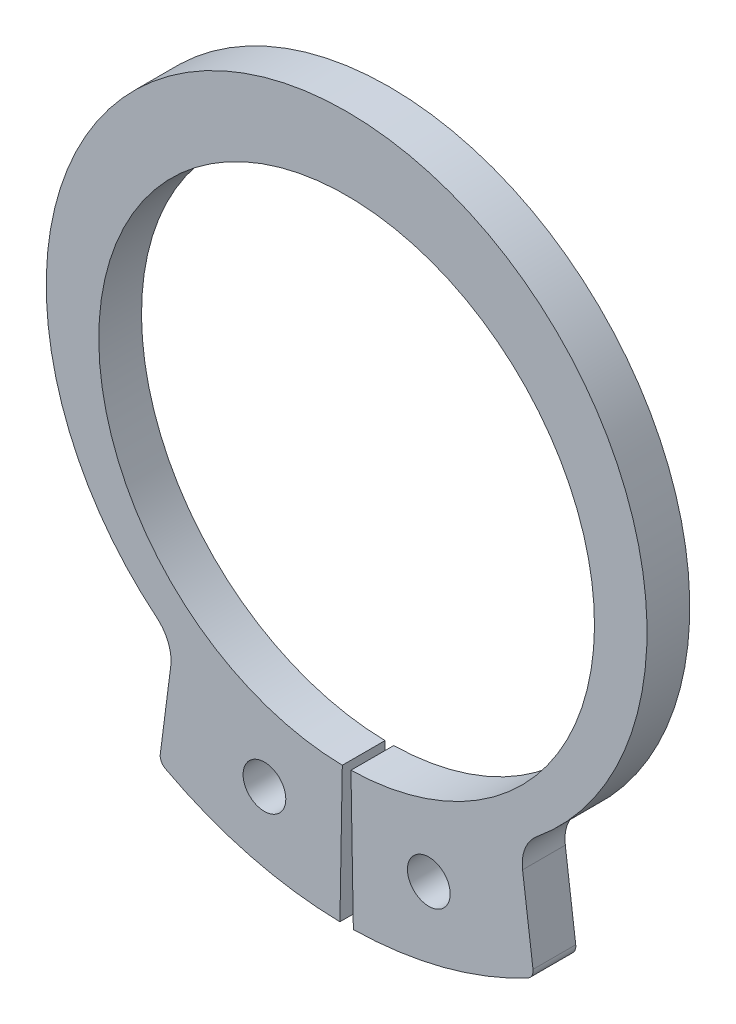
ISO-10303-21;
HEADER;
FILE_DESCRIPTION(('STEP AP214'),'2;1');
FILE_NAME('part.step','',(''),(''),'','','');
FILE_SCHEMA(('AUTOMOTIVE_DESIGN { 1 0 10303 214 1 1 1 1 }'));
ENDSEC;
DATA;
#1=APPLICATION_CONTEXT('core data for automotive mechanical design processes');
#2=APPLICATION_PROTOCOL_DEFINITION('international standard','automotive_design',2000,#1);
#3=PRODUCT_CONTEXT('',#1,'mechanical');
#4=PRODUCT('Part','Part','',(#3));
#5=PRODUCT_RELATED_PRODUCT_CATEGORY('part','',(#4));
#6=PRODUCT_DEFINITION_FORMATION('','',#4);
#7=PRODUCT_DEFINITION_CONTEXT('part definition',#1,'design');
#8=PRODUCT_DEFINITION('design','',#6,#7);
#9=PRODUCT_DEFINITION_SHAPE('','',#8);
#10=(LENGTH_UNIT() NAMED_UNIT(*) SI_UNIT(.MILLI.,.METRE.));
#11=(NAMED_UNIT(*) PLANE_ANGLE_UNIT() SI_UNIT($,.RADIAN.));
#12=(NAMED_UNIT(*) SI_UNIT($,.STERADIAN.) SOLID_ANGLE_UNIT());
#13=UNCERTAINTY_MEASURE_WITH_UNIT(LENGTH_MEASURE(1.E-05),#10,'distance_accuracy_value','');
#14=(GEOMETRIC_REPRESENTATION_CONTEXT(3) GLOBAL_UNCERTAINTY_ASSIGNED_CONTEXT((#13)) GLOBAL_UNIT_ASSIGNED_CONTEXT((#10,
#11,#12)) REPRESENTATION_CONTEXT('',''));
#15=CARTESIAN_POINT('',(0.,0.,0.));
#16=DIRECTION('',(0.,0.,1.));
#17=DIRECTION('',(1.,0.,0.));
#18=AXIS2_PLACEMENT_3D('',#15,#16,#17);
#19=CARTESIAN_POINT('',(0.,0.941428346580996,1.));
#20=DIRECTION('',(0.,0.,1.));
#21=DIRECTION('',(1.,0.,0.));
#22=AXIS2_PLACEMENT_3D('',#19,#20,#21);
#23=PLANE('',#22);
#24=DIRECTION('',(-0.127590580964938,-0.991826922224351,0.));
#25=VECTOR('',#24,1.);
#26=CARTESIAN_POINT('',(-8.76223313562183,-15.726474066602,1.));
#27=LINE('',#26,#25);
#28=CARTESIAN_POINT('',(-8.2337790965981,-11.6185302113579,1.));
#29=VERTEX_POINT('',#28);
#30=CARTESIAN_POINT('',(-8.72163862360933,-15.410912137155,1.));
#31=VERTEX_POINT('',#30);
#32=EDGE_CURVE('E193',#29,#31,#27,.T.);
#33=ORIENTED_EDGE('',*,*,#32,.T.);
#34=CARTESIAN_POINT('',(-8.26003790730853,-15.4702933681409,1.));
#35=DIRECTION('',(0.,0.,1.));
#36=DIRECTION('',(1.,0.,0.));
#37=AXIS2_PLACEMENT_3D('',#34,#35,#36);
#38=CIRCLE('',#37,0.46540450350509);
#39=CARTESIAN_POINT('',(-8.47924215440834,-15.8808428169729,1.));
#40=VERTEX_POINT('',#39);
#41=EDGE_CURVE('E12',#31,#40,#38,.T.);
#42=ORIENTED_EDGE('',*,*,#41,.T.);
#43=CARTESIAN_POINT('',(0.,0.,1.));
#44=DIRECTION('',(0.,0.,1.));
#45=DIRECTION('',(1.,0.,0.));
#46=AXIS2_PLACEMENT_3D('',#43,#44,#45);
#47=CIRCLE('',#46,18.0027419047903);
#48=CARTESIAN_POINT('',(-0.314191168707932,-18.,1.));
#49=VERTEX_POINT('',#48);
#50=EDGE_CURVE('E196',#40,#49,#47,.T.);
#51=ORIENTED_EDGE('',*,*,#50,.T.);
#52=DIRECTION('',(0.0174524064372855,0.999847695156391,0.));
#53=VECTOR('',#52,1.);
#54=CARTESIAN_POINT('',(-0.314191168707932,-18.,1.));
#55=LINE('',#54,#53);
#56=CARTESIAN_POINT('',(-0.202447914672499,-11.5982332638141,1.));
#57=VERTEX_POINT('',#56);
#58=EDGE_CURVE('E198',#49,#57,#55,.T.);
#59=ORIENTED_EDGE('',*,*,#58,.T.);
#60=CARTESIAN_POINT('',(0.,0.,1.));
#61=DIRECTION('',(0.,0.,-1.));
#62=DIRECTION('',(1.,0.,0.));
#63=AXIS2_PLACEMENT_3D('',#60,#61,#62);
#64=CIRCLE('',#63,11.6);
#65=CARTESIAN_POINT('',(0.202447914672493,-11.5982332638141,1.));
#66=VERTEX_POINT('',#65);
#67=EDGE_CURVE('E152',#57,#66,#64,.T.);
#68=ORIENTED_EDGE('',*,*,#67,.T.);
#69=DIRECTION('',(-0.017452406437285,0.999847695156391,0.));
#70=VECTOR('',#69,1.);
#71=CARTESIAN_POINT('',(0.314191168707923,-18.,1.));
#72=LINE('',#71,#70);
#73=CARTESIAN_POINT('',(0.314191168707923,-18.,1.));
#74=VERTEX_POINT('',#73);
#75=EDGE_CURVE('E132',#74,#66,#72,.T.);
#76=ORIENTED_EDGE('',*,*,#75,.F.);
#77=CARTESIAN_POINT('',(0.,0.,1.));
#78=DIRECTION('',(0.,0.,-1.));
#79=DIRECTION('',(-1.,0.,0.));
#80=AXIS2_PLACEMENT_3D('',#77,#78,#79);
#81=CIRCLE('',#80,18.0027419047903);
#82=CARTESIAN_POINT('',(8.47924215440833,-15.8808428169729,1.));
#83=VERTEX_POINT('',#82);
#84=EDGE_CURVE('E142',#83,#74,#81,.T.);
#85=ORIENTED_EDGE('',*,*,#84,.F.);
#86=CARTESIAN_POINT('',(8.26003790730852,-15.4702933681409,1.));
#87=DIRECTION('',(0.,0.,-1.));
#88=DIRECTION('',(-1.,0.,0.));
#89=AXIS2_PLACEMENT_3D('',#86,#87,#88);
#90=CIRCLE('',#89,0.46540450350509);
#91=CARTESIAN_POINT('',(8.72163862360932,-15.410912137155,1.));
#92=VERTEX_POINT('',#91);
#93=EDGE_CURVE('E181',#92,#83,#90,.T.);
#94=ORIENTED_EDGE('',*,*,#93,.F.);
#95=DIRECTION('',(0.127590580964938,-0.991826922224351,0.));
#96=VECTOR('',#95,1.);
#97=CARTESIAN_POINT('',(8.76223313562182,-15.726474066602,1.));
#98=LINE('',#97,#96);
#99=CARTESIAN_POINT('',(8.2337790965981,-11.618530211358,1.));
#100=VERTEX_POINT('',#99);
#101=EDGE_CURVE('E148',#100,#92,#98,.T.);
#102=ORIENTED_EDGE('',*,*,#101,.F.);
#103=CARTESIAN_POINT('',(10.0801819618013,-11.3810052874143,1.));
#104=DIRECTION('',(0.,0.,-1.));
#105=DIRECTION('',(-1.,0.,0.));
#106=AXIS2_PLACEMENT_3D('',#103,#104,#105);
#107=CIRCLE('',#106,1.86161801402036);
#108=CARTESIAN_POINT('',(8.90146181356889,-9.94008875885477,1.));
#109=VERTEX_POINT('',#108);
#110=EDGE_CURVE('E172',#109,#100,#107,.F.);
#111=ORIENTED_EDGE('',*,*,#110,.F.);
#112=CARTESIAN_POINT('',(0.,0.941428346580996,1.));
#113=DIRECTION('',(0.,0.,1.));
#114=DIRECTION('',(1.,0.,0.));
#115=AXIS2_PLACEMENT_3D('',#112,#113,#114);
#116=CIRCLE('',#115,14.058571653419);
#117=CARTESIAN_POINT('',(-8.9014618135689,-9.94008875885477,1.));
#118=VERTEX_POINT('',#117);
#119=EDGE_CURVE('E190',#109,#118,#116,.T.);
#120=ORIENTED_EDGE('',*,*,#119,.T.);
#121=CARTESIAN_POINT('',(-10.0801819618013,-11.3810052874143,1.));
#122=DIRECTION('',(0.,0.,1.));
#123=DIRECTION('',(1.,0.,0.));
#124=AXIS2_PLACEMENT_3D('',#121,#122,#123);
#125=CIRCLE('',#124,1.86161801402036);
#126=EDGE_CURVE('E223',#118,#29,#125,.F.);
#127=ORIENTED_EDGE('',*,*,#126,.T.);
#128=EDGE_LOOP('',(#33,#42,#51,#59,#68,#76,#85,#94,#102,#111,#120,#127));
#129=FACE_BOUND('',#128,.T.);
#130=CARTESIAN_POINT('',(-3.84647005038051,-14.2928391239086,1.));
#131=DIRECTION('',(0.,0.,1.));
#132=DIRECTION('',(1.,0.,0.));
#133=AXIS2_PLACEMENT_3D('',#130,#131,#132);
#134=CIRCLE('',#133,1.);
#135=CARTESIAN_POINT('',(-2.84647005038051,-14.2928391239086,1.));
#136=VERTEX_POINT('',#135);
#137=EDGE_CURVE('E184',#136,#136,#134,.T.);
#138=ORIENTED_EDGE('',*,*,#137,.F.);
#139=EDGE_LOOP('',(#138));
#140=FACE_BOUND('',#139,.T.);
#141=CARTESIAN_POINT('',(3.8464700503805,-14.2928391239086,1.));
#142=DIRECTION('',(0.,0.,-1.));
#143=DIRECTION('',(-1.,0.,0.));
#144=AXIS2_PLACEMENT_3D('',#141,#142,#143);
#145=CIRCLE('',#144,1.);
#146=CARTESIAN_POINT('',(2.8464700503805,-14.2928391239086,1.));
#147=VERTEX_POINT('',#146);
#148=EDGE_CURVE('E162',#147,#147,#145,.T.);
#149=ORIENTED_EDGE('',*,*,#148,.T.);
#150=EDGE_LOOP('',(#149));
#151=FACE_BOUND('',#150,.T.);
#152=ADVANCED_FACE('F38',(#129,#140,#151),#23,.T.);
#153=CARTESIAN_POINT('',(0.,0.941428346580996,-1.));
#154=DIRECTION('',(0.,0.,1.));
#155=DIRECTION('',(1.,0.,0.));
#156=AXIS2_PLACEMENT_3D('',#153,#154,#155);
#157=PLANE('',#156);
#158=CARTESIAN_POINT('',(0.,0.,-1.));
#159=DIRECTION('',(0.,0.,1.));
#160=DIRECTION('',(1.,0.,0.));
#161=AXIS2_PLACEMENT_3D('',#158,#159,#160);
#162=CIRCLE('',#161,18.0027419047903);
#163=CARTESIAN_POINT('',(-8.47924215440834,-15.8808428169729,-1.));
#164=VERTEX_POINT('',#163);
#165=CARTESIAN_POINT('',(-0.314191168707932,-18.,-1.));
#166=VERTEX_POINT('',#165);
#167=EDGE_CURVE('E206',#164,#166,#162,.T.);
#168=ORIENTED_EDGE('',*,*,#167,.F.);
#169=CARTESIAN_POINT('',(-8.26003790730853,-15.4702933681409,-1.));
#170=DIRECTION('',(0.,0.,1.));
#171=DIRECTION('',(1.,0.,0.));
#172=AXIS2_PLACEMENT_3D('',#169,#170,#171);
#173=CIRCLE('',#172,0.46540450350509);
#174=CARTESIAN_POINT('',(-8.72163862360933,-15.410912137155,-1.));
#175=VERTEX_POINT('',#174);
#176=EDGE_CURVE('E60',#164,#175,#173,.F.);
#177=ORIENTED_EDGE('',*,*,#176,.T.);
#178=DIRECTION('',(-0.127590580964938,-0.991826922224351,0.));
#179=VECTOR('',#178,1.);
#180=CARTESIAN_POINT('',(-8.76223313562183,-15.726474066602,-1.));
#181=LINE('',#180,#179);
#182=CARTESIAN_POINT('',(-8.2337790965981,-11.6185302113579,-1.));
#183=VERTEX_POINT('',#182);
#184=EDGE_CURVE('E204',#183,#175,#181,.T.);
#185=ORIENTED_EDGE('',*,*,#184,.F.);
#186=CARTESIAN_POINT('',(-10.0801819618013,-11.3810052874143,-1.));
#187=DIRECTION('',(0.,0.,1.));
#188=DIRECTION('',(1.,0.,0.));
#189=AXIS2_PLACEMENT_3D('',#186,#187,#188);
#190=CIRCLE('',#189,1.86161801402036);
#191=CARTESIAN_POINT('',(-8.9014618135689,-9.94008875885477,-1.));
#192=VERTEX_POINT('',#191);
#193=EDGE_CURVE('E221',#183,#192,#190,.T.);
#194=ORIENTED_EDGE('',*,*,#193,.T.);
#195=CARTESIAN_POINT('',(0.,0.941428346580996,-1.));
#196=DIRECTION('',(0.,0.,1.));
#197=DIRECTION('',(1.,0.,0.));
#198=AXIS2_PLACEMENT_3D('',#195,#196,#197);
#199=CIRCLE('',#198,14.058571653419);
#200=CARTESIAN_POINT('',(8.90146181356889,-9.94008875885477,-1.));
#201=VERTEX_POINT('',#200);
#202=EDGE_CURVE('E187',#201,#192,#199,.T.);
#203=ORIENTED_EDGE('',*,*,#202,.F.);
#204=CARTESIAN_POINT('',(10.0801819618013,-11.3810052874143,-1.));
#205=DIRECTION('',(0.,0.,-1.));
#206=DIRECTION('',(-1.,0.,0.));
#207=AXIS2_PLACEMENT_3D('',#204,#205,#206);
#208=CIRCLE('',#207,1.86161801402036);
#209=CARTESIAN_POINT('',(8.2337790965981,-11.618530211358,-1.));
#210=VERTEX_POINT('',#209);
#211=EDGE_CURVE('E169',#210,#201,#208,.T.);
#212=ORIENTED_EDGE('',*,*,#211,.F.);
#213=DIRECTION('',(0.127590580964938,-0.991826922224351,0.));
#214=VECTOR('',#213,1.);
#215=CARTESIAN_POINT('',(8.76223313562182,-15.726474066602,-1.));
#216=LINE('',#215,#214);
#217=CARTESIAN_POINT('',(8.72163862360932,-15.410912137155,-1.));
#218=VERTEX_POINT('',#217);
#219=EDGE_CURVE('E158',#210,#218,#216,.T.);
#220=ORIENTED_EDGE('',*,*,#219,.T.);
#221=CARTESIAN_POINT('',(8.26003790730852,-15.4702933681409,-1.));
#222=DIRECTION('',(0.,0.,-1.));
#223=DIRECTION('',(-1.,0.,0.));
#224=AXIS2_PLACEMENT_3D('',#221,#222,#223);
#225=CIRCLE('',#224,0.46540450350509);
#226=CARTESIAN_POINT('',(8.47924215440833,-15.8808428169729,-1.));
#227=VERTEX_POINT('',#226);
#228=EDGE_CURVE('E176',#227,#218,#225,.F.);
#229=ORIENTED_EDGE('',*,*,#228,.F.);
#230=CARTESIAN_POINT('',(0.,0.,-1.));
#231=DIRECTION('',(0.,0.,-1.));
#232=DIRECTION('',(-1.,0.,0.));
#233=AXIS2_PLACEMENT_3D('',#230,#231,#232);
#234=CIRCLE('',#233,18.0027419047903);
#235=CARTESIAN_POINT('',(0.314191168707923,-18.,-1.));
#236=VERTEX_POINT('',#235);
#237=EDGE_CURVE('E161',#227,#236,#234,.T.);
#238=ORIENTED_EDGE('',*,*,#237,.T.);
#239=DIRECTION('',(-0.017452406437285,0.999847695156391,0.));
#240=VECTOR('',#239,1.);
#241=CARTESIAN_POINT('',(0.314191168707923,-18.,-1.));
#242=LINE('',#241,#240);
#243=CARTESIAN_POINT('',(0.202447914672493,-11.5982332638141,-1.));
#244=VERTEX_POINT('',#243);
#245=EDGE_CURVE('E134',#236,#244,#242,.T.);
#246=ORIENTED_EDGE('',*,*,#245,.T.);
#247=CARTESIAN_POINT('',(0.,0.,-1.));
#248=DIRECTION('',(0.,0.,-1.));
#249=DIRECTION('',(1.,0.,0.));
#250=AXIS2_PLACEMENT_3D('',#247,#248,#249);
#251=CIRCLE('',#250,11.6);
#252=CARTESIAN_POINT('',(-0.202447914672499,-11.5982332638141,-1.));
#253=VERTEX_POINT('',#252);
#254=EDGE_CURVE('E194',#253,#244,#251,.T.);
#255=ORIENTED_EDGE('',*,*,#254,.F.);
#256=DIRECTION('',(0.0174524064372855,0.999847695156391,0.));
#257=VECTOR('',#256,1.);
#258=CARTESIAN_POINT('',(-0.314191168707932,-18.,-1.));
#259=LINE('',#258,#257);
#260=EDGE_CURVE('E208',#166,#253,#259,.T.);
#261=ORIENTED_EDGE('',*,*,#260,.F.);
#262=EDGE_LOOP('',(#168,#177,#185,#194,#203,#212,#220,#229,#238,#246,#255,#261));
#263=FACE_BOUND('',#262,.T.);
#264=CARTESIAN_POINT('',(-3.84647005038051,-14.2928391239086,-1.));
#265=DIRECTION('',(0.,0.,1.));
#266=DIRECTION('',(1.,0.,0.));
#267=AXIS2_PLACEMENT_3D('',#264,#265,#266);
#268=CIRCLE('',#267,1.);
#269=CARTESIAN_POINT('',(-2.84647005038051,-14.2928391239086,-1.));
#270=VERTEX_POINT('',#269);
#271=EDGE_CURVE('E183',#270,#270,#268,.T.);
#272=ORIENTED_EDGE('',*,*,#271,.T.);
#273=EDGE_LOOP('',(#272));
#274=FACE_BOUND('',#273,.T.);
#275=CARTESIAN_POINT('',(3.8464700503805,-14.2928391239086,-1.));
#276=DIRECTION('',(0.,0.,-1.));
#277=DIRECTION('',(-1.,0.,0.));
#278=AXIS2_PLACEMENT_3D('',#275,#276,#277);
#279=CIRCLE('',#278,1.);
#280=CARTESIAN_POINT('',(2.8464700503805,-14.2928391239086,-1.));
#281=VERTEX_POINT('',#280);
#282=EDGE_CURVE('E256',#281,#281,#279,.T.);
#283=ORIENTED_EDGE('',*,*,#282,.F.);
#284=EDGE_LOOP('',(#283));
#285=FACE_BOUND('',#284,.T.);
#286=ADVANCED_FACE('F236',(#263,#274,#285),#157,.F.);
#287=CARTESIAN_POINT('',(0.,0.941428346580996,1.));
#288=DIRECTION('',(0.,0.,-1.));
#289=DIRECTION('',(-1.,0.,0.));
#290=AXIS2_PLACEMENT_3D('',#287,#288,#289);
#291=CYLINDRICAL_SURFACE('',#290,14.058571653419);
#292=ORIENTED_EDGE('',*,*,#202,.T.);
#293=DIRECTION('',(0.,0.,-1.));
#294=VECTOR('',#293,1.);
#295=CARTESIAN_POINT('',(-8.9014618135689,-9.94008875885477,1.));
#296=LINE('',#295,#294);
#297=EDGE_CURVE('E219',#192,#118,#296,.F.);
#298=ORIENTED_EDGE('',*,*,#297,.T.);
#299=ORIENTED_EDGE('',*,*,#119,.F.);
#300=DIRECTION('',(0.,0.,-1.));
#301=VECTOR('',#300,1.);
#302=CARTESIAN_POINT('',(8.90146181356889,-9.94008875885477,1.));
#303=LINE('',#302,#301);
#304=EDGE_CURVE('E166',#201,#109,#303,.F.);
#305=ORIENTED_EDGE('',*,*,#304,.F.);
#306=EDGE_LOOP('',(#292,#298,#299,#305));
#307=FACE_BOUND('',#306,.T.);
#308=ADVANCED_FACE('F271',(#307),#291,.T.);
#309=CARTESIAN_POINT('',(-8.76223313562183,-15.726474066602,1.));
#310=DIRECTION('',(0.991826922224352,-0.127590580964938,0.));
#311=DIRECTION('',(0.127590580964938,0.991826922224351,0.));
#312=AXIS2_PLACEMENT_3D('',#309,#310,#311);
#313=PLANE('',#312);
#314=ORIENTED_EDGE('',*,*,#184,.T.);
#315=DIRECTION('',(0.,0.,-1.));
#316=VECTOR('',#315,1.);
#317=CARTESIAN_POINT('',(-8.72163862360933,-15.410912137155,1.));
#318=LINE('',#317,#316);
#319=EDGE_CURVE('E46',#175,#31,#318,.F.);
#320=ORIENTED_EDGE('',*,*,#319,.T.);
#321=ORIENTED_EDGE('',*,*,#32,.F.);
#322=DIRECTION('',(0.,0.,1.));
#323=VECTOR('',#322,1.);
#324=CARTESIAN_POINT('',(-8.2337790965981,-11.6185302113579,-1.));
#325=LINE('',#324,#323);
#326=EDGE_CURVE('E216',#29,#183,#325,.F.);
#327=ORIENTED_EDGE('',*,*,#326,.T.);
#328=EDGE_LOOP('',(#314,#320,#321,#327));
#329=FACE_BOUND('',#328,.T.);
#330=ADVANCED_FACE('F277',(#329),#313,.F.);
#331=CARTESIAN_POINT('',(0.,0.,1.));
#332=DIRECTION('',(0.,0.,-1.));
#333=DIRECTION('',(-1.,0.,0.));
#334=AXIS2_PLACEMENT_3D('',#331,#332,#333);
#335=CYLINDRICAL_SURFACE('',#334,18.0027419047903);
#336=ORIENTED_EDGE('',*,*,#50,.F.);
#337=DIRECTION('',(0.,0.,-1.));
#338=VECTOR('',#337,1.);
#339=CARTESIAN_POINT('',(-8.47924215440834,-15.8808428169729,1.));
#340=LINE('',#339,#338);
#341=EDGE_CURVE('E225',#40,#164,#340,.T.);
#342=ORIENTED_EDGE('',*,*,#341,.T.);
#343=ORIENTED_EDGE('',*,*,#167,.T.);
#344=DIRECTION('',(0.,0.,-1.));
#345=VECTOR('',#344,1.);
#346=CARTESIAN_POINT('',(-0.314191168707932,-18.,1.));
#347=LINE('',#346,#345);
#348=EDGE_CURVE('E213',#49,#166,#347,.T.);
#349=ORIENTED_EDGE('',*,*,#348,.F.);
#350=EDGE_LOOP('',(#336,#342,#343,#349));
#351=FACE_BOUND('',#350,.T.);
#352=ADVANCED_FACE('F231',(#351),#335,.T.);
#353=CARTESIAN_POINT('',(-0.314191168707932,-18.,1.));
#354=DIRECTION('',(-0.999847695156391,0.0174524064372855,0.));
#355=DIRECTION('',(-0.0174524064372855,-0.999847695156391,0.));
#356=AXIS2_PLACEMENT_3D('',#353,#354,#355);
#357=PLANE('',#356);
#358=ORIENTED_EDGE('',*,*,#260,.T.);
#359=DIRECTION('',(0.,0.,-1.));
#360=VECTOR('',#359,1.);
#361=CARTESIAN_POINT('',(-0.202447914672499,-11.5982332638141,1.));
#362=LINE('',#361,#360);
#363=EDGE_CURVE('E201',#57,#253,#362,.T.);
#364=ORIENTED_EDGE('',*,*,#363,.F.);
#365=ORIENTED_EDGE('',*,*,#58,.F.);
#366=ORIENTED_EDGE('',*,*,#348,.T.);
#367=EDGE_LOOP('',(#358,#364,#365,#366));
#368=FACE_BOUND('',#367,.T.);
#369=ADVANCED_FACE('F241',(#368),#357,.F.);
#370=CARTESIAN_POINT('',(0.,0.,1.));
#371=DIRECTION('',(0.,0.,-1.));
#372=DIRECTION('',(-1.,0.,0.));
#373=AXIS2_PLACEMENT_3D('',#370,#371,#372);
#374=CYLINDRICAL_SURFACE('',#373,11.6);
#375=ORIENTED_EDGE('',*,*,#254,.T.);
#376=DIRECTION('',(0.,0.,-1.));
#377=VECTOR('',#376,1.);
#378=CARTESIAN_POINT('',(0.202447914672493,-11.5982332638141,1.));
#379=LINE('',#378,#377);
#380=EDGE_CURVE('E139',#66,#244,#379,.T.);
#381=ORIENTED_EDGE('',*,*,#380,.F.);
#382=ORIENTED_EDGE('',*,*,#67,.F.);
#383=ORIENTED_EDGE('',*,*,#363,.T.);
#384=EDGE_LOOP('',(#375,#381,#382,#383));
#385=FACE_BOUND('',#384,.T.);
#386=ADVANCED_FACE('F244',(#385),#374,.F.);
#387=CARTESIAN_POINT('',(-3.84647005038051,-14.2928391239086,1.));
#388=DIRECTION('',(0.,0.,-1.));
#389=DIRECTION('',(-1.,0.,0.));
#390=AXIS2_PLACEMENT_3D('',#387,#388,#389);
#391=CYLINDRICAL_SURFACE('',#390,1.);
#392=ORIENTED_EDGE('',*,*,#137,.T.);
#393=EDGE_LOOP('',(#392));
#394=FACE_BOUND('',#393,.T.);
#395=ORIENTED_EDGE('',*,*,#271,.F.);
#396=EDGE_LOOP('',(#395));
#397=FACE_BOUND('',#396,.T.);
#398=ADVANCED_FACE('F285',(#394,#397),#391,.F.);
#399=CARTESIAN_POINT('',(-10.0801819618013,-11.3810052874143,1.));
#400=DIRECTION('',(0.,0.,-1.));
#401=DIRECTION('',(-1.,0.,0.));
#402=AXIS2_PLACEMENT_3D('',#399,#400,#401);
#403=CYLINDRICAL_SURFACE('',#402,1.86161801402036);
#404=ORIENTED_EDGE('',*,*,#126,.F.);
#405=ORIENTED_EDGE('',*,*,#297,.F.);
#406=ORIENTED_EDGE('',*,*,#193,.F.);
#407=ORIENTED_EDGE('',*,*,#326,.F.);
#408=EDGE_LOOP('',(#404,#405,#406,#407));
#409=FACE_BOUND('',#408,.T.);
#410=ADVANCED_FACE('F291',(#409),#403,.F.);
#411=CARTESIAN_POINT('',(-8.26003790730853,-15.4702933681409,1.));
#412=DIRECTION('',(0.,0.,-1.));
#413=DIRECTION('',(-1.,0.,0.));
#414=AXIS2_PLACEMENT_3D('',#411,#412,#413);
#415=CYLINDRICAL_SURFACE('',#414,0.46540450350509);
#416=ORIENTED_EDGE('',*,*,#41,.F.);
#417=ORIENTED_EDGE('',*,*,#319,.F.);
#418=ORIENTED_EDGE('',*,*,#176,.F.);
#419=ORIENTED_EDGE('',*,*,#341,.F.);
#420=EDGE_LOOP('',(#416,#417,#418,#419));
#421=FACE_BOUND('',#420,.T.);
#422=ADVANCED_FACE('F40',(#421),#415,.T.);
#423=CARTESIAN_POINT('',(8.76223313562182,-15.726474066602,1.));
#424=DIRECTION('',(-0.991826922224352,-0.127590580964938,0.));
#425=DIRECTION('',(-0.127590580964938,0.991826922224351,0.));
#426=AXIS2_PLACEMENT_3D('',#423,#424,#425);
#427=PLANE('',#426);
#428=ORIENTED_EDGE('',*,*,#219,.F.);
#429=DIRECTION('',(0.,0.,1.));
#430=VECTOR('',#429,1.);
#431=CARTESIAN_POINT('',(8.2337790965981,-11.618530211358,-1.));
#432=LINE('',#431,#430);
#433=EDGE_CURVE('E138',#100,#210,#432,.F.);
#434=ORIENTED_EDGE('',*,*,#433,.F.);
#435=ORIENTED_EDGE('',*,*,#101,.T.);
#436=DIRECTION('',(0.,0.,-1.));
#437=VECTOR('',#436,1.);
#438=CARTESIAN_POINT('',(8.72163862360932,-15.410912137155,1.));
#439=LINE('',#438,#437);
#440=EDGE_CURVE('E179',#218,#92,#439,.F.);
#441=ORIENTED_EDGE('',*,*,#440,.F.);
#442=EDGE_LOOP('',(#428,#434,#435,#441));
#443=FACE_BOUND('',#442,.T.);
#444=ADVANCED_FACE('F254',(#443),#427,.F.);
#445=CARTESIAN_POINT('',(0.,0.,1.));
#446=DIRECTION('',(0.,0.,-1.));
#447=DIRECTION('',(1.,0.,0.));
#448=AXIS2_PLACEMENT_3D('',#445,#446,#447);
#449=CYLINDRICAL_SURFACE('',#448,18.0027419047903);
#450=ORIENTED_EDGE('',*,*,#84,.T.);
#451=DIRECTION('',(0.,0.,-1.));
#452=VECTOR('',#451,1.);
#453=CARTESIAN_POINT('',(0.314191168707923,-18.,1.));
#454=LINE('',#453,#452);
#455=EDGE_CURVE('E127',#74,#236,#454,.T.);
#456=ORIENTED_EDGE('',*,*,#455,.T.);
#457=ORIENTED_EDGE('',*,*,#237,.F.);
#458=DIRECTION('',(0.,0.,-1.));
#459=VECTOR('',#458,1.);
#460=CARTESIAN_POINT('',(8.47924215440833,-15.8808428169729,1.));
#461=LINE('',#460,#459);
#462=EDGE_CURVE('E144',#83,#227,#461,.T.);
#463=ORIENTED_EDGE('',*,*,#462,.F.);
#464=EDGE_LOOP('',(#450,#456,#457,#463));
#465=FACE_BOUND('',#464,.T.);
#466=ADVANCED_FACE('F143',(#465),#449,.T.);
#467=CARTESIAN_POINT('',(0.314191168707923,-18.,1.));
#468=DIRECTION('',(0.999847695156391,0.017452406437285,0.));
#469=DIRECTION('',(0.017452406437285,-0.999847695156391,0.));
#470=AXIS2_PLACEMENT_3D('',#467,#468,#469);
#471=PLANE('',#470);
#472=ORIENTED_EDGE('',*,*,#245,.F.);
#473=ORIENTED_EDGE('',*,*,#455,.F.);
#474=ORIENTED_EDGE('',*,*,#75,.T.);
#475=ORIENTED_EDGE('',*,*,#380,.T.);
#476=EDGE_LOOP('',(#472,#473,#474,#475));
#477=FACE_BOUND('',#476,.T.);
#478=ADVANCED_FACE('F129',(#477),#471,.F.);
#479=CARTESIAN_POINT('',(3.8464700503805,-14.2928391239086,1.));
#480=DIRECTION('',(0.,0.,-1.));
#481=DIRECTION('',(1.,0.,0.));
#482=AXIS2_PLACEMENT_3D('',#479,#480,#481);
#483=CYLINDRICAL_SURFACE('',#482,1.);
#484=ORIENTED_EDGE('',*,*,#148,.F.);
#485=EDGE_LOOP('',(#484));
#486=FACE_BOUND('',#485,.T.);
#487=ORIENTED_EDGE('',*,*,#282,.T.);
#488=EDGE_LOOP('',(#487));
#489=FACE_BOUND('',#488,.T.);
#490=ADVANCED_FACE('F263',(#486,#489),#483,.F.);
#491=CARTESIAN_POINT('',(10.0801819618013,-11.3810052874143,1.));
#492=DIRECTION('',(0.,0.,-1.));
#493=DIRECTION('',(1.,0.,0.));
#494=AXIS2_PLACEMENT_3D('',#491,#492,#493);
#495=CYLINDRICAL_SURFACE('',#494,1.86161801402036);
#496=ORIENTED_EDGE('',*,*,#110,.T.);
#497=ORIENTED_EDGE('',*,*,#433,.T.);
#498=ORIENTED_EDGE('',*,*,#211,.T.);
#499=ORIENTED_EDGE('',*,*,#304,.T.);
#500=EDGE_LOOP('',(#496,#497,#498,#499));
#501=FACE_BOUND('',#500,.T.);
#502=ADVANCED_FACE('F266',(#501),#495,.F.);
#503=CARTESIAN_POINT('',(8.26003790730852,-15.4702933681409,1.));
#504=DIRECTION('',(0.,0.,-1.));
#505=DIRECTION('',(1.,0.,0.));
#506=AXIS2_PLACEMENT_3D('',#503,#504,#505);
#507=CYLINDRICAL_SURFACE('',#506,0.46540450350509);
#508=ORIENTED_EDGE('',*,*,#93,.T.);
#509=ORIENTED_EDGE('',*,*,#462,.T.);
#510=ORIENTED_EDGE('',*,*,#228,.T.);
#511=ORIENTED_EDGE('',*,*,#440,.T.);
#512=EDGE_LOOP('',(#508,#509,#510,#511));
#513=FACE_BOUND('',#512,.T.);
#514=ADVANCED_FACE('F249',(#513),#507,.T.);
#515=CLOSED_SHELL('',(#152,#286,#308,#330,#352,#369,#386,#398,#410,#422,#444,#466,#478,#490,
#502,#514));
#516=MANIFOLD_SOLID_BREP('B2',#515);
#517=ADVANCED_BREP_SHAPE_REPRESENTATION('',(#18,#516),#14);
#518=SHAPE_DEFINITION_REPRESENTATION(#9,#517);
ENDSEC;
END-ISO-10303-21;
